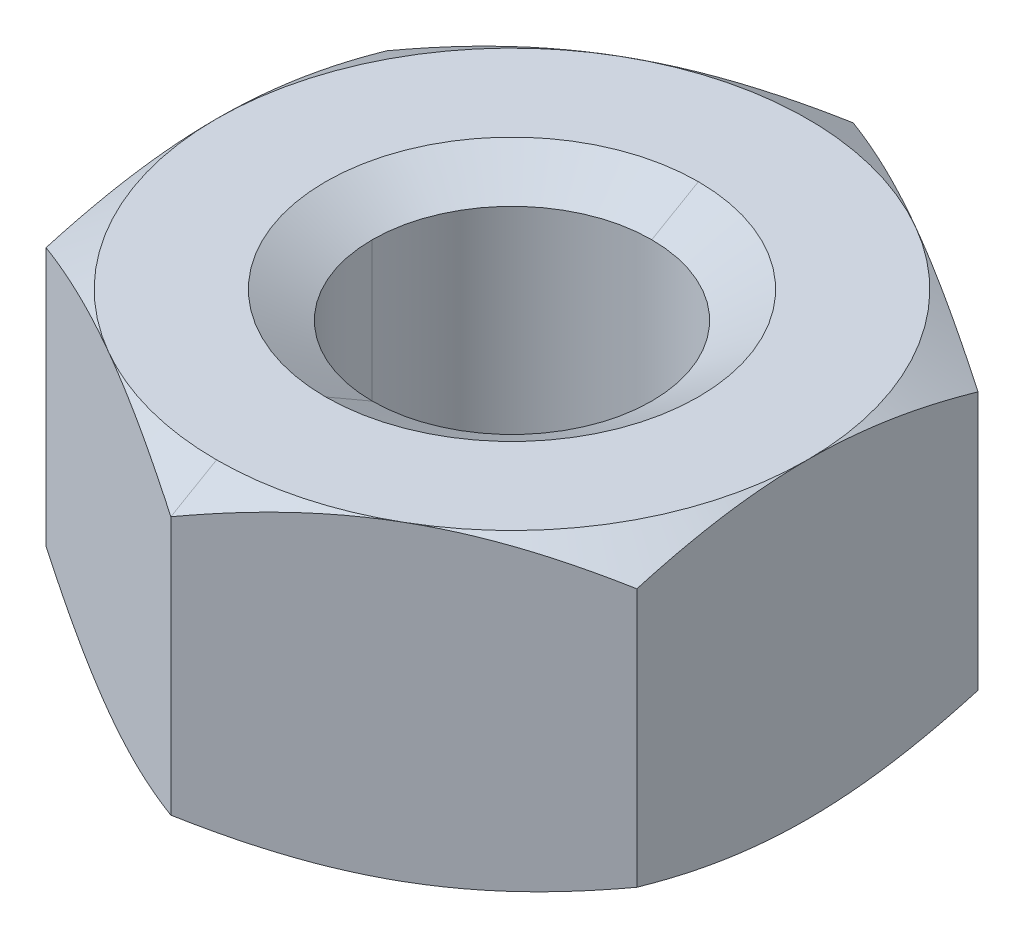
ISO-10303-21;
HEADER;
FILE_DESCRIPTION(('STEP AP214'),'2;1');
FILE_NAME('part.step','',(''),(''),'','','');
FILE_SCHEMA(('AUTOMOTIVE_DESIGN { 1 0 10303 214 1 1 1 1 }'));
ENDSEC;
DATA;
#1=APPLICATION_CONTEXT('core data for automotive mechanical design processes');
#2=APPLICATION_PROTOCOL_DEFINITION('international standard','automotive_design',2000,#1);
#3=PRODUCT_CONTEXT('',#1,'mechanical');
#4=PRODUCT('Part','Part','',(#3));
#5=PRODUCT_RELATED_PRODUCT_CATEGORY('part','',(#4));
#6=PRODUCT_DEFINITION_FORMATION('','',#4);
#7=PRODUCT_DEFINITION_CONTEXT('part definition',#1,'design');
#8=PRODUCT_DEFINITION('design','',#6,#7);
#9=PRODUCT_DEFINITION_SHAPE('','',#8);
#10=(LENGTH_UNIT() NAMED_UNIT(*) SI_UNIT(.MILLI.,.METRE.));
#11=(NAMED_UNIT(*) PLANE_ANGLE_UNIT() SI_UNIT($,.RADIAN.));
#12=(NAMED_UNIT(*) SI_UNIT($,.STERADIAN.) SOLID_ANGLE_UNIT());
#13=UNCERTAINTY_MEASURE_WITH_UNIT(LENGTH_MEASURE(1.E-05),#10,'distance_accuracy_value','');
#14=(GEOMETRIC_REPRESENTATION_CONTEXT(3) GLOBAL_UNCERTAINTY_ASSIGNED_CONTEXT((#13)) GLOBAL_UNIT_ASSIGNED_CONTEXT((#10,
#11,#12)) REPRESENTATION_CONTEXT('',''));
#15=CARTESIAN_POINT('',(0.,0.,0.));
#16=DIRECTION('',(0.,0.,1.));
#17=DIRECTION('',(1.,0.,0.));
#18=AXIS2_PLACEMENT_3D('',#15,#16,#17);
#19=CARTESIAN_POINT('',(86.966,103.008,0.));
#20=DIRECTION('',(0.,1.,0.));
#21=DIRECTION('',(0.,0.,1.));
#22=AXIS2_PLACEMENT_3D('',#19,#20,#21);
#23=CONICAL_SURFACE('',#22,5.9944,1.0471975511966);
#24=DIRECTION('',(0.,0.5,-0.86602540378444));
#25=VECTOR('',#24,1.);
#26=CARTESIAN_POINT('',(86.966,103.008,-5.9944));
#27=LINE('',#26,#25);
#28=CARTESIAN_POINT('',(86.966,102.141974596216,-4.49440000000007));
#29=VERTEX_POINT('',#28);
#30=CARTESIAN_POINT('',(86.966,103.008,-5.9944));
#31=VERTEX_POINT('',#30);
#32=EDGE_CURVE('E258',#29,#31,#27,.T.);
#33=ORIENTED_EDGE('',*,*,#32,.F.);
#34=CARTESIAN_POINT('',(86.966,102.141974596216,0.));
#35=DIRECTION('',(0.,1.,0.));
#36=DIRECTION('',(0.,0.,1.));
#37=AXIS2_PLACEMENT_3D('',#34,#35,#36);
#38=CIRCLE('',#37,4.49440000000007);
#39=CARTESIAN_POINT('',(91.4604,102.141974596216,0.));
#40=VERTEX_POINT('',#39);
#41=EDGE_CURVE('E11',#40,#29,#38,.T.);
#42=ORIENTED_EDGE('',*,*,#41,.F.);
#43=CARTESIAN_POINT('',(86.966,102.141974596216,0.));
#44=DIRECTION('',(0.,1.,0.));
#45=DIRECTION('',(0.,0.,1.));
#46=AXIS2_PLACEMENT_3D('',#43,#44,#45);
#47=CIRCLE('',#46,4.49440000000007);
#48=CARTESIAN_POINT('',(86.966,102.141974596216,4.49440000000007));
#49=VERTEX_POINT('',#48);
#50=EDGE_CURVE('E91',#49,#40,#47,.T.);
#51=ORIENTED_EDGE('',*,*,#50,.F.);
#52=DIRECTION('',(0.,0.5,0.86602540378444));
#53=VECTOR('',#52,1.);
#54=CARTESIAN_POINT('',(86.966,103.008,5.9944));
#55=LINE('',#54,#53);
#56=CARTESIAN_POINT('',(86.966,103.008,5.9944));
#57=VERTEX_POINT('',#56);
#58=EDGE_CURVE('E254',#49,#57,#55,.T.);
#59=ORIENTED_EDGE('',*,*,#58,.T.);
#60=CARTESIAN_POINT('',(86.966,103.008,0.));
#61=DIRECTION('',(0.,-1.,0.));
#62=DIRECTION('',(0.,0.,1.));
#63=AXIS2_PLACEMENT_3D('',#60,#61,#62);
#64=CIRCLE('',#63,5.9944);
#65=EDGE_CURVE('E51',#31,#57,#64,.T.);
#66=ORIENTED_EDGE('',*,*,#65,.F.);
#67=EDGE_LOOP('',(#33,#42,#51,#59,#66));
#68=FACE_BOUND('',#67,.T.);
#69=ADVANCED_FACE('F38',(#68),#23,.F.);
#70=CARTESIAN_POINT('',(86.966,93.0004,0.));
#71=DIRECTION('',(0.,1.,0.));
#72=DIRECTION('',(0.,0.,-1.));
#73=AXIS2_PLACEMENT_3D('',#70,#71,#72);
#74=CONICAL_SURFACE('',#73,9.4996,1.0471975511966);
#75=CARTESIAN_POINT('',(77.4664,93.8488700494729,5.48459661719378));
#76=CARTESIAN_POINT('',(78.7019089284808,93.4370337399786,6.19791802963837));
#77=CARTESIAN_POINT('',(79.8169469914146,93.2288766993012,6.84168555542987));
#78=CARTESIAN_POINT('',(81.0408316862839,93.0004,7.54829571346974));
#79=CARTESIAN_POINT('',(82.2162,93.0004,8.22689492579067));
#80=B_SPLINE_CURVE_WITH_KNOTS('',2,(#75,#76,#77,#78,#79),.UNSPECIFIED.,.F.,.F.,(3,2,3),(0.,0.5,
1.),.UNSPECIFIED.);
#81=CARTESIAN_POINT('',(77.4664,93.8488700494728,5.48459661719377));
#82=VERTEX_POINT('',#81);
#83=CARTESIAN_POINT('',(82.2162,93.0004,8.22689492579067));
#84=VERTEX_POINT('',#83);
#85=EDGE_CURVE('E443',#82,#84,#80,.T.);
#86=ORIENTED_EDGE('',*,*,#85,.F.);
#87=CARTESIAN_POINT('',(77.4664,93.0004,0.));
#88=CARTESIAN_POINT('',(77.4664,93.0004,1.36302312218737));
#89=CARTESIAN_POINT('',(77.4664,93.23105838735,2.78388561921775));
#90=CARTESIAN_POINT('',(77.4664,93.4389825683326,4.0647047317508));
#91=CARTESIAN_POINT('',(77.4664,93.8488700494729,5.48459661719377));
#92=B_SPLINE_CURVE_WITH_KNOTS('',2,(#87,#88,#89,#90,#91),.UNSPECIFIED.,.F.,.F.,(3,2,3),(0.,0.5,
1.),.UNSPECIFIED.);
#93=CARTESIAN_POINT('',(77.4664,93.0004,0.));
#94=VERTEX_POINT('',#93);
#95=EDGE_CURVE('E317',#94,#82,#92,.T.);
#96=ORIENTED_EDGE('',*,*,#95,.F.);
#97=CARTESIAN_POINT('',(86.966,93.0004,0.));
#98=DIRECTION('',(0.,-1.,0.));
#99=DIRECTION('',(0.,0.,1.));
#100=AXIS2_PLACEMENT_3D('',#97,#98,#99);
#101=CIRCLE('',#100,9.4996);
#102=EDGE_CURVE('E642',#84,#94,#101,.T.);
#103=ORIENTED_EDGE('',*,*,#102,.F.);
#104=EDGE_LOOP('',(#86,#96,#103));
#105=FACE_BOUND('',#104,.T.);
#106=ADVANCED_FACE('F325',(#105),#74,.T.);
#107=CARTESIAN_POINT('',(86.966,93.0004,0.));
#108=DIRECTION('',(0.,1.,0.));
#109=DIRECTION('',(0.,0.,-1.));
#110=AXIS2_PLACEMENT_3D('',#107,#108,#109);
#111=CONICAL_SURFACE('',#110,9.4996,1.0471975511966);
#112=CARTESIAN_POINT('',(82.2162,93.0004,-8.22689492579068));
#113=CARTESIAN_POINT('',(81.0398464616265,93.0004,-7.54772689374855));
#114=CARTESIAN_POINT('',(79.8139198548295,93.2294420372649,-6.83993783730757));
#115=CARTESIAN_POINT('',(78.700767190529,93.4374143192961,-6.19725884692456));
#116=CARTESIAN_POINT('',(77.4664,93.8488700494729,-5.48459661719378));
#117=B_SPLINE_CURVE_WITH_KNOTS('',2,(#112,#113,#114,#115,#116),.UNSPECIFIED.,.F.,.F.,(3,2,3),
(0.,0.5,1.),.UNSPECIFIED.);
#118=CARTESIAN_POINT('',(82.2162,93.0004,-8.22689492579067));
#119=VERTEX_POINT('',#118);
#120=CARTESIAN_POINT('',(77.4664,93.8488700494728,-5.48459661719378));
#121=VERTEX_POINT('',#120);
#122=EDGE_CURVE('E797',#119,#121,#117,.T.);
#123=ORIENTED_EDGE('',*,*,#122,.F.);
#124=CARTESIAN_POINT('',(86.966,93.0004,0.));
#125=DIRECTION('',(0.,1.,0.));
#126=DIRECTION('',(0.,0.,-1.));
#127=AXIS2_PLACEMENT_3D('',#124,#125,#126);
#128=CIRCLE('',#127,9.4996);
#129=EDGE_CURVE('E323',#119,#94,#128,.T.);
#130=ORIENTED_EDGE('',*,*,#129,.T.);
#131=CARTESIAN_POINT('',(77.4664,93.8488700494729,-5.48459661719377));
#132=CARTESIAN_POINT('',(77.4664,93.4359389183844,-4.05416121904976));
#133=CARTESIAN_POINT('',(77.4664,93.2277519686827,-2.76345251145925));
#134=CARTESIAN_POINT('',(77.4664,93.0004,-1.35392532405791));
#135=CARTESIAN_POINT('',(77.4664,93.0004,0.));
#136=B_SPLINE_CURVE_WITH_KNOTS('',2,(#131,#132,#133,#134,#135),.UNSPECIFIED.,.F.,.F.,(3,2,3),
(0.,0.5,1.),.UNSPECIFIED.);
#137=EDGE_CURVE('E806',#121,#94,#136,.T.);
#138=ORIENTED_EDGE('',*,*,#137,.F.);
#139=EDGE_LOOP('',(#123,#130,#138));
#140=FACE_BOUND('',#139,.T.);
#141=ADVANCED_FACE('F335',(#140),#111,.T.);
#142=CARTESIAN_POINT('',(86.966,93.0004,0.));
#143=DIRECTION('',(0.,1.,0.));
#144=DIRECTION('',(0.,0.,-1.));
#145=AXIS2_PLACEMENT_3D('',#142,#143,#144);
#146=CONICAL_SURFACE('',#145,9.4996,1.0471975511966);
#147=DIRECTION('',(0.,0.5,-0.86602540378444));
#148=VECTOR('',#147,1.);
#149=CARTESIAN_POINT('',(86.966,93.0004,-9.4996));
#150=LINE('',#149,#148);
#151=CARTESIAN_POINT('',(86.966,93.0004,-9.4996));
#152=VERTEX_POINT('',#151);
#153=CARTESIAN_POINT('',(86.966,93.8488700494728,-10.9691932343875));
#154=VERTEX_POINT('',#153);
#155=EDGE_CURVE('E509',#152,#154,#150,.T.);
#156=ORIENTED_EDGE('',*,*,#155,.F.);
#157=CARTESIAN_POINT('',(86.966,93.0004,0.));
#158=DIRECTION('',(0.,-1.,0.));
#159=DIRECTION('',(0.,0.,1.));
#160=AXIS2_PLACEMENT_3D('',#157,#158,#159);
#161=CIRCLE('',#160,9.4996);
#162=EDGE_CURVE('E627',#119,#152,#161,.T.);
#163=ORIENTED_EDGE('',*,*,#162,.F.);
#164=CARTESIAN_POINT('',(86.966,93.8488700494729,-10.9691932343876));
#165=CARTESIAN_POINT('',(85.7304910713691,93.4370337399286,-10.2558718218563));
#166=CARTESIAN_POINT('',(84.6154530085854,93.2288766993012,-9.61210429615148));
#167=CARTESIAN_POINT('',(83.3915683135868,93.0004,-8.90549413803694));
#168=CARTESIAN_POINT('',(82.2162,93.0004,-8.22689492579068));
#169=B_SPLINE_CURVE_WITH_KNOTS('',2,(#164,#165,#166,#167,#168),.UNSPECIFIED.,.F.,.F.,(3,2,3),
(0.,0.5,1.),.UNSPECIFIED.);
#170=EDGE_CURVE('E238',#154,#119,#169,.T.);
#171=ORIENTED_EDGE('',*,*,#170,.F.);
#172=EDGE_LOOP('',(#156,#163,#171));
#173=FACE_BOUND('',#172,.T.);
#174=ADVANCED_FACE('F607',(#173),#146,.T.);
#175=CARTESIAN_POINT('',(86.966,93.0004,0.));
#176=DIRECTION('',(0.,1.,0.));
#177=DIRECTION('',(0.,0.,-1.));
#178=AXIS2_PLACEMENT_3D('',#175,#176,#177);
#179=CONICAL_SURFACE('',#178,9.4996,1.0471975511966);
#180=CARTESIAN_POINT('',(96.4656,93.0004,0.));
#181=CARTESIAN_POINT('',(96.4656,93.0004,-1.35341300572912));
#182=CARTESIAN_POINT('',(96.4656,93.2277519686823,-2.76345251145672));
#183=CARTESIAN_POINT('',(96.4656,93.4357675717653,-4.05356765694959));
#184=CARTESIAN_POINT('',(96.4656,93.8488700494729,-5.48459661719377));
#185=B_SPLINE_CURVE_WITH_KNOTS('',2,(#180,#181,#182,#183,#184),.UNSPECIFIED.,.F.,.F.,(3,2,3),
(0.,0.5,1.),.UNSPECIFIED.);
#186=CARTESIAN_POINT('',(96.4656,93.0004,0.));
#187=VERTEX_POINT('',#186);
#188=CARTESIAN_POINT('',(96.4656,93.8488700494728,-5.48459661719377));
#189=VERTEX_POINT('',#188);
#190=EDGE_CURVE('E533',#187,#189,#185,.T.);
#191=ORIENTED_EDGE('',*,*,#190,.F.);
#192=CARTESIAN_POINT('',(86.966,93.0004,0.));
#193=DIRECTION('',(0.,-1.,0.));
#194=DIRECTION('',(0.,0.,1.));
#195=AXIS2_PLACEMENT_3D('',#192,#193,#194);
#196=CIRCLE('',#195,9.4996);
#197=CARTESIAN_POINT('',(91.7158,93.0004,-8.22689492579067));
#198=VERTEX_POINT('',#197);
#199=EDGE_CURVE('E619',#198,#187,#196,.T.);
#200=ORIENTED_EDGE('',*,*,#199,.F.);
#201=CARTESIAN_POINT('',(96.4656,93.8488700494729,-5.48459661719377));
#202=CARTESIAN_POINT('',(95.2300910714615,93.4370337399594,-6.19791802967168));
#203=CARTESIAN_POINT('',(94.1150530085854,93.2288766993012,-6.84168555542985));
#204=CARTESIAN_POINT('',(92.8911683136669,93.0004,-7.54829571349814));
#205=CARTESIAN_POINT('',(91.7158,93.0004,-8.22689492579063));
#206=B_SPLINE_CURVE_WITH_KNOTS('',2,(#201,#202,#203,#204,#205),.UNSPECIFIED.,.F.,.F.,(3,2,3),
(0.,0.5,1.),.UNSPECIFIED.);
#207=EDGE_CURVE('E591',#189,#198,#206,.T.);
#208=ORIENTED_EDGE('',*,*,#207,.F.);
#209=EDGE_LOOP('',(#191,#200,#208));
#210=FACE_BOUND('',#209,.T.);
#211=ADVANCED_FACE('F598',(#210),#179,.T.);
#212=CARTESIAN_POINT('',(86.966,93.0004,0.));
#213=DIRECTION('',(0.,1.,0.));
#214=DIRECTION('',(0.,0.,-1.));
#215=AXIS2_PLACEMENT_3D('',#212,#213,#214);
#216=CONICAL_SURFACE('',#215,9.4996,1.0471975511966);
#217=CARTESIAN_POINT('',(96.4656,93.8488700494729,5.48459661719377));
#218=CARTESIAN_POINT('',(96.4656,93.439151381845,4.06528951891212));
#219=CARTESIAN_POINT('',(96.4656,93.2310583873496,2.78388561921574));
#220=CARTESIAN_POINT('',(96.4656,93.0004,1.3635275828278));
#221=CARTESIAN_POINT('',(96.4656,93.0004,0.));
#222=B_SPLINE_CURVE_WITH_KNOTS('',2,(#217,#218,#219,#220,#221),.UNSPECIFIED.,.F.,.F.,(3,2,3),
(0.,0.5,1.),.UNSPECIFIED.);
#223=CARTESIAN_POINT('',(96.4656,93.8488700494728,5.48459661719377));
#224=VERTEX_POINT('',#223);
#225=EDGE_CURVE('E522',#224,#187,#222,.T.);
#226=ORIENTED_EDGE('',*,*,#225,.F.);
#227=CARTESIAN_POINT('',(91.7158,93.0004,8.22689492579063));
#228=CARTESIAN_POINT('',(92.8921535385219,93.0004,7.54772689366284));
#229=CARTESIAN_POINT('',(94.1180801451706,93.2294420372649,6.83993783730752));
#230=CARTESIAN_POINT('',(95.2312328096419,93.4374143193532,6.19725884682586));
#231=CARTESIAN_POINT('',(96.4656,93.8488700494729,5.48459661719377));
#232=B_SPLINE_CURVE_WITH_KNOTS('',2,(#227,#228,#229,#230,#231),.UNSPECIFIED.,.F.,.F.,(3,2,3),
(0.,0.5,1.),.UNSPECIFIED.);
#233=CARTESIAN_POINT('',(91.7158,93.0004,8.22689492579067));
#234=VERTEX_POINT('',#233);
#235=EDGE_CURVE('E472',#234,#224,#232,.T.);
#236=ORIENTED_EDGE('',*,*,#235,.F.);
#237=CARTESIAN_POINT('',(86.966,93.0004,0.));
#238=DIRECTION('',(0.,-1.,0.));
#239=DIRECTION('',(0.,0.,1.));
#240=AXIS2_PLACEMENT_3D('',#237,#238,#239);
#241=CIRCLE('',#240,9.4996);
#242=EDGE_CURVE('E437',#187,#234,#241,.T.);
#243=ORIENTED_EDGE('',*,*,#242,.F.);
#244=EDGE_LOOP('',(#226,#236,#243));
#245=FACE_BOUND('',#244,.T.);
#246=ADVANCED_FACE('F289',(#245),#216,.T.);
#247=CARTESIAN_POINT('',(86.966,93.0004,0.));
#248=DIRECTION('',(0.,1.,0.));
#249=DIRECTION('',(0.,0.,-1.));
#250=AXIS2_PLACEMENT_3D('',#247,#248,#249);
#251=CONICAL_SURFACE('',#250,9.4996,1.0471975511966);
#252=CARTESIAN_POINT('',(86.966,93.8488700494729,10.9691932343875));
#253=CARTESIAN_POINT('',(88.2015089285018,93.4370337399717,10.2558718219309));
#254=CARTESIAN_POINT('',(89.3165469914146,93.2288766993012,9.61210429615145));
#255=CARTESIAN_POINT('',(90.5404316863015,93.0004,8.90549413810141));
#256=CARTESIAN_POINT('',(91.7158,93.0004,8.22689492579063));
#257=B_SPLINE_CURVE_WITH_KNOTS('',2,(#252,#253,#254,#255,#256),.UNSPECIFIED.,.F.,.F.,(3,2,3),
(0.,0.5,1.),.UNSPECIFIED.);
#258=CARTESIAN_POINT('',(86.966,93.8488700494728,10.9691932343875));
#259=VERTEX_POINT('',#258);
#260=EDGE_CURVE('E404',#259,#234,#257,.T.);
#261=ORIENTED_EDGE('',*,*,#260,.F.);
#262=CARTESIAN_POINT('',(82.2162,93.0004,8.22689492579067));
#263=CARTESIAN_POINT('',(83.3925535383645,93.0004,8.90606295782758));
#264=CARTESIAN_POINT('',(84.6184801451706,93.2294420372649,9.61385201427381));
#265=CARTESIAN_POINT('',(85.7316328094596,93.4374143192924,10.2565310046502));
#266=CARTESIAN_POINT('',(86.966,93.8488700494729,10.9691932343875));
#267=B_SPLINE_CURVE_WITH_KNOTS('',2,(#262,#263,#264,#265,#266),.UNSPECIFIED.,.F.,.F.,(3,2,3),
(0.,0.5,1.),.UNSPECIFIED.);
#268=EDGE_CURVE('E452',#84,#259,#267,.T.);
#269=ORIENTED_EDGE('',*,*,#268,.F.);
#270=CARTESIAN_POINT('',(86.966,93.0004,0.));
#271=DIRECTION('',(0.,-1.,0.));
#272=DIRECTION('',(0.,0.,1.));
#273=AXIS2_PLACEMENT_3D('',#270,#271,#272);
#274=CIRCLE('',#273,9.4996);
#275=EDGE_CURVE('E228',#234,#84,#274,.T.);
#276=ORIENTED_EDGE('',*,*,#275,.F.);
#277=EDGE_LOOP('',(#261,#269,#276));
#278=FACE_BOUND('',#277,.T.);
#279=ADVANCED_FACE('F411',(#278),#251,.T.);
#280=CARTESIAN_POINT('',(86.966,103.008,0.));
#281=DIRECTION('',(0.,-1.,0.));
#282=DIRECTION('',(0.,0.,1.));
#283=AXIS2_PLACEMENT_3D('',#280,#281,#282);
#284=CONICAL_SURFACE('',#283,9.4996,1.0471975511966);
#285=CARTESIAN_POINT('',(82.2162,103.008,-8.22689492579067));
#286=CARTESIAN_POINT('',(83.3925535379302,103.008,-8.90606295757681));
#287=CARTESIAN_POINT('',(84.6184801451706,102.778957962735,-9.61385201427379));
#288=CARTESIAN_POINT('',(85.7316328089558,102.570985680876,-10.2565310043593));
#289=CARTESIAN_POINT('',(86.966,102.159529950527,-10.9691932343875));
#290=B_SPLINE_CURVE_WITH_KNOTS('',2,(#285,#286,#287,#288,#289),.UNSPECIFIED.,.F.,.F.,(3,2,3),
(0.,0.5,1.),.UNSPECIFIED.);
#291=CARTESIAN_POINT('',(82.2162,103.008,-8.22689492579067));
#292=VERTEX_POINT('',#291);
#293=CARTESIAN_POINT('',(86.966,102.159529950527,-10.9691932343875));
#294=VERTEX_POINT('',#293);
#295=EDGE_CURVE('E718',#292,#294,#290,.T.);
#296=ORIENTED_EDGE('',*,*,#295,.F.);
#297=CARTESIAN_POINT('',(86.966,103.008,0.));
#298=DIRECTION('',(0.,-1.,0.));
#299=DIRECTION('',(0.,0.,1.));
#300=AXIS2_PLACEMENT_3D('',#297,#298,#299);
#301=CIRCLE('',#300,9.4996);
#302=CARTESIAN_POINT('',(91.7158,103.008,-8.22689492579065));
#303=VERTEX_POINT('',#302);
#304=EDGE_CURVE('E695',#292,#303,#301,.T.);
#305=ORIENTED_EDGE('',*,*,#304,.T.);
#306=CARTESIAN_POINT('',(86.966,102.159529950527,-10.9691932343875));
#307=CARTESIAN_POINT('',(88.2015089283859,102.57136625999,-10.2558718219978));
#308=CARTESIAN_POINT('',(89.3165469914146,102.779523300699,-9.61210429615146));
#309=CARTESIAN_POINT('',(90.5404316862011,103.008,-8.90549413815939));
#310=CARTESIAN_POINT('',(91.7158,103.008,-8.22689492579064));
#311=B_SPLINE_CURVE_WITH_KNOTS('',2,(#306,#307,#308,#309,#310),.UNSPECIFIED.,.F.,.F.,(3,2,3),
(0.,0.5,1.),.UNSPECIFIED.);
#312=EDGE_CURVE('E706',#294,#303,#311,.T.);
#313=ORIENTED_EDGE('',*,*,#312,.F.);
#314=EDGE_LOOP('',(#296,#305,#313));
#315=FACE_BOUND('',#314,.T.);
#316=ADVANCED_FACE('F419',(#315),#284,.T.);
#317=CARTESIAN_POINT('',(86.966,103.008,0.));
#318=DIRECTION('',(0.,-1.,0.));
#319=DIRECTION('',(0.,0.,1.));
#320=AXIS2_PLACEMENT_3D('',#317,#318,#319);
#321=CONICAL_SURFACE('',#320,9.4996,1.0471975511966);
#322=CARTESIAN_POINT('',(91.7158,103.008,-8.22689492579064));
#323=CARTESIAN_POINT('',(92.8921535381863,103.008,-7.54772689385664));
#324=CARTESIAN_POINT('',(94.1180801451706,102.778957962735,-6.83993783730752));
#325=CARTESIAN_POINT('',(95.2312328092525,102.570985680777,-6.19725884705067));
#326=CARTESIAN_POINT('',(96.4656,102.159529950527,-5.48459661719378));
#327=B_SPLINE_CURVE_WITH_KNOTS('',2,(#322,#323,#324,#325,#326),.UNSPECIFIED.,.F.,.F.,(3,2,3),
(0.,0.5,1.),.UNSPECIFIED.);
#328=CARTESIAN_POINT('',(96.4656,102.159529950527,-5.48459661719377));
#329=VERTEX_POINT('',#328);
#330=EDGE_CURVE('E553',#303,#329,#327,.T.);
#331=ORIENTED_EDGE('',*,*,#330,.F.);
#332=CARTESIAN_POINT('',(86.966,103.008,0.));
#333=DIRECTION('',(0.,-1.,0.));
#334=DIRECTION('',(0.,0.,1.));
#335=AXIS2_PLACEMENT_3D('',#332,#333,#334);
#336=CIRCLE('',#335,9.4996);
#337=CARTESIAN_POINT('',(96.4656,103.008,0.));
#338=VERTEX_POINT('',#337);
#339=EDGE_CURVE('E703',#303,#338,#336,.T.);
#340=ORIENTED_EDGE('',*,*,#339,.T.);
#341=CARTESIAN_POINT('',(96.4656,102.159529950527,-5.48459661719377));
#342=CARTESIAN_POINT('',(96.4656,102.572461081576,-4.0541612191853));
#343=CARTESIAN_POINT('',(96.4656,102.780648031318,-2.76345251145672));
#344=CARTESIAN_POINT('',(96.4656,103.008,-1.35392532417536));
#345=CARTESIAN_POINT('',(96.4656,103.008,0.));
#346=B_SPLINE_CURVE_WITH_KNOTS('',2,(#341,#342,#343,#344,#345),.UNSPECIFIED.,.F.,.F.,(3,2,3),
(0.,0.5,1.),.UNSPECIFIED.);
#347=EDGE_CURVE('E1237',#329,#338,#346,.T.);
#348=ORIENTED_EDGE('',*,*,#347,.F.);
#349=EDGE_LOOP('',(#331,#340,#348));
#350=FACE_BOUND('',#349,.T.);
#351=ADVANCED_FACE('F680',(#350),#321,.T.);
#352=CARTESIAN_POINT('',(86.966,103.008,0.));
#353=DIRECTION('',(0.,-1.,0.));
#354=DIRECTION('',(0.,0.,1.));
#355=AXIS2_PLACEMENT_3D('',#352,#353,#354);
#356=CONICAL_SURFACE('',#355,9.4996,1.0471975511966);
#357=CARTESIAN_POINT('',(96.4656,103.008,0.));
#358=CARTESIAN_POINT('',(96.4656,103.008,1.36302312200608));
#359=CARTESIAN_POINT('',(96.4656,102.77734161265,2.78388561921576));
#360=CARTESIAN_POINT('',(96.4656,102.569417431728,4.06470473154006));
#361=CARTESIAN_POINT('',(96.4656,102.159529950527,5.48459661719377));
#362=B_SPLINE_CURVE_WITH_KNOTS('',2,(#357,#358,#359,#360,#361),.UNSPECIFIED.,.F.,.F.,(3,2,3),
(0.,0.5,1.),.UNSPECIFIED.);
#363=CARTESIAN_POINT('',(96.4656,102.159529950527,5.48459661719377));
#364=VERTEX_POINT('',#363);
#365=EDGE_CURVE('E526',#338,#364,#362,.T.);
#366=ORIENTED_EDGE('',*,*,#365,.F.);
#367=CARTESIAN_POINT('',(86.966,103.008,0.));
#368=DIRECTION('',(0.,-1.,0.));
#369=DIRECTION('',(0.,0.,1.));
#370=AXIS2_PLACEMENT_3D('',#367,#368,#369);
#371=CIRCLE('',#370,9.4996);
#372=CARTESIAN_POINT('',(91.7158,103.008,8.22689492579064));
#373=VERTEX_POINT('',#372);
#374=EDGE_CURVE('E227',#338,#373,#371,.T.);
#375=ORIENTED_EDGE('',*,*,#374,.T.);
#376=CARTESIAN_POINT('',(96.4656,102.159529950527,5.48459661719377));
#377=CARTESIAN_POINT('',(95.230091071617,102.571366259989,6.19791802958189));
#378=CARTESIAN_POINT('',(94.1150530085854,102.779523300699,6.84168555542983));
#379=CARTESIAN_POINT('',(92.8911683138015,103.008,7.54829571342039));
#380=CARTESIAN_POINT('',(91.7158,103.008,8.22689492579064));
#381=B_SPLINE_CURVE_WITH_KNOTS('',2,(#376,#377,#378,#379,#380),.UNSPECIFIED.,.F.,.F.,(3,2,3),
(0.,0.5,1.),.UNSPECIFIED.);
#382=EDGE_CURVE('E357',#364,#373,#381,.T.);
#383=ORIENTED_EDGE('',*,*,#382,.F.);
#384=EDGE_LOOP('',(#366,#375,#383));
#385=FACE_BOUND('',#384,.T.);
#386=ADVANCED_FACE('F374',(#385),#356,.T.);
#387=CARTESIAN_POINT('',(86.966,103.008,0.));
#388=DIRECTION('',(0.,-1.,0.));
#389=DIRECTION('',(0.,0.,1.));
#390=AXIS2_PLACEMENT_3D('',#387,#388,#389);
#391=CONICAL_SURFACE('',#390,9.4996,1.0471975511966);
#392=DIRECTION('',(0.,-0.5,0.86602540378444));
#393=VECTOR('',#392,1.);
#394=CARTESIAN_POINT('',(86.966,103.008,9.4996));
#395=LINE('',#394,#393);
#396=CARTESIAN_POINT('',(86.966,103.008,9.4996));
#397=VERTEX_POINT('',#396);
#398=CARTESIAN_POINT('',(86.966,102.159529950527,10.9691932343875));
#399=VERTEX_POINT('',#398);
#400=EDGE_CURVE('E480',#397,#399,#395,.T.);
#401=ORIENTED_EDGE('',*,*,#400,.F.);
#402=CARTESIAN_POINT('',(86.966,103.008,0.));
#403=DIRECTION('',(0.,-1.,0.));
#404=DIRECTION('',(0.,0.,1.));
#405=AXIS2_PLACEMENT_3D('',#402,#403,#404);
#406=CIRCLE('',#405,9.4996);
#407=CARTESIAN_POINT('',(82.2162,103.008,8.22689492579067));
#408=VERTEX_POINT('',#407);
#409=EDGE_CURVE('E264',#397,#408,#406,.T.);
#410=ORIENTED_EDGE('',*,*,#409,.T.);
#411=CARTESIAN_POINT('',(86.966,102.159529950527,10.9691932343875));
#412=CARTESIAN_POINT('',(85.7304910715937,102.571366259996,10.255871821986));
#413=CARTESIAN_POINT('',(84.6154530085854,102.779523300699,9.61210429615147));
#414=CARTESIAN_POINT('',(83.391568313781,103.008,8.90549413814905));
#415=CARTESIAN_POINT('',(82.2162,103.008,8.22689492579067));
#416=B_SPLINE_CURVE_WITH_KNOTS('',2,(#411,#412,#413,#414,#415),.UNSPECIFIED.,.F.,.F.,(3,2,3),
(0.,0.5,1.),.UNSPECIFIED.);
#417=EDGE_CURVE('E464',#399,#408,#416,.T.);
#418=ORIENTED_EDGE('',*,*,#417,.F.);
#419=EDGE_LOOP('',(#401,#410,#418));
#420=FACE_BOUND('',#419,.T.);
#421=ADVANCED_FACE('F775',(#420),#391,.T.);
#422=CARTESIAN_POINT('',(86.966,103.008,0.));
#423=DIRECTION('',(0.,-1.,0.));
#424=DIRECTION('',(0.,0.,1.));
#425=AXIS2_PLACEMENT_3D('',#422,#423,#424);
#426=CONICAL_SURFACE('',#425,9.4996,1.0471975511966);
#427=CARTESIAN_POINT('',(82.2162,103.008,8.22689492579067));
#428=CARTESIAN_POINT('',(81.0398464618099,103.008,7.54772689385446));
#429=CARTESIAN_POINT('',(79.8139198548294,102.778957962735,6.83993783730753));
#430=CARTESIAN_POINT('',(78.7007671907429,102.570985680775,6.19725884704801));
#431=CARTESIAN_POINT('',(77.4664,102.159529950527,5.48459661719378));
#432=B_SPLINE_CURVE_WITH_KNOTS('',2,(#427,#428,#429,#430,#431),.UNSPECIFIED.,.F.,.F.,(3,2,3),
(0.,0.5,1.),.UNSPECIFIED.);
#433=CARTESIAN_POINT('',(77.4664,102.159529950527,5.48459661719377));
#434=VERTEX_POINT('',#433);
#435=EDGE_CURVE('E815',#408,#434,#432,.T.);
#436=ORIENTED_EDGE('',*,*,#435,.F.);
#437=CARTESIAN_POINT('',(86.966,103.008,0.));
#438=DIRECTION('',(0.,-1.,0.));
#439=DIRECTION('',(0.,0.,1.));
#440=AXIS2_PLACEMENT_3D('',#437,#438,#439);
#441=CIRCLE('',#440,9.4996);
#442=CARTESIAN_POINT('',(77.4664,103.008,0.));
#443=VERTEX_POINT('',#442);
#444=EDGE_CURVE('E65',#408,#443,#441,.T.);
#445=ORIENTED_EDGE('',*,*,#444,.T.);
#446=CARTESIAN_POINT('',(77.4664,102.159529950527,5.48459661719377));
#447=CARTESIAN_POINT('',(77.4664,102.569248618079,4.06528951917682));
#448=CARTESIAN_POINT('',(77.4664,102.77734161265,2.78388561921775));
#449=CARTESIAN_POINT('',(77.4664,103.008,1.36352758305683));
#450=CARTESIAN_POINT('',(77.4664,103.008,0.));
#451=B_SPLINE_CURVE_WITH_KNOTS('',2,(#446,#447,#448,#449,#450),.UNSPECIFIED.,.F.,.F.,(3,2,3),
(0.,0.5,1.),.UNSPECIFIED.);
#452=EDGE_CURVE('E799',#434,#443,#451,.T.);
#453=ORIENTED_EDGE('',*,*,#452,.F.);
#454=EDGE_LOOP('',(#436,#445,#453));
#455=FACE_BOUND('',#454,.T.);
#456=ADVANCED_FACE('F737',(#455),#426,.T.);
#457=CARTESIAN_POINT('',(86.966,103.008,0.));
#458=DIRECTION('',(0.,-1.,0.));
#459=DIRECTION('',(0.,0.,1.));
#460=AXIS2_PLACEMENT_3D('',#457,#458,#459);
#461=CONICAL_SURFACE('',#460,9.4996,1.0471975511966);
#462=CARTESIAN_POINT('',(77.4664,102.159529950527,-5.48459661719378));
#463=CARTESIAN_POINT('',(78.7019089284062,102.571366259996,-6.1979180295953));
#464=CARTESIAN_POINT('',(79.8169469914146,102.779523300699,-6.84168555542986));
#465=CARTESIAN_POINT('',(81.0408316862191,103.008,-7.54829571343228));
#466=CARTESIAN_POINT('',(82.2162,103.008,-8.22689492579067));
#467=B_SPLINE_CURVE_WITH_KNOTS('',2,(#462,#463,#464,#465,#466),.UNSPECIFIED.,.F.,.F.,(3,2,3),
(0.,0.5,1.),.UNSPECIFIED.);
#468=CARTESIAN_POINT('',(77.4664,102.159529950527,-5.48459661719378));
#469=VERTEX_POINT('',#468);
#470=EDGE_CURVE('E725',#469,#292,#467,.T.);
#471=ORIENTED_EDGE('',*,*,#470,.F.);
#472=CARTESIAN_POINT('',(77.4664,103.008,0.));
#473=CARTESIAN_POINT('',(77.4664,103.008,-1.35341300515855));
#474=CARTESIAN_POINT('',(77.4664,102.780648031317,-2.76345251145925));
#475=CARTESIAN_POINT('',(77.4664,102.572632428426,-4.05356765628856));
#476=CARTESIAN_POINT('',(77.4664,102.159529950527,-5.48459661719377));
#477=B_SPLINE_CURVE_WITH_KNOTS('',2,(#472,#473,#474,#475,#476),.UNSPECIFIED.,.F.,.F.,(3,2,3),
(0.,0.5,1.),.UNSPECIFIED.);
#478=EDGE_CURVE('E175',#443,#469,#477,.T.);
#479=ORIENTED_EDGE('',*,*,#478,.F.);
#480=CARTESIAN_POINT('',(86.966,103.008,0.));
#481=DIRECTION('',(0.,-1.,0.));
#482=DIRECTION('',(0.,0.,1.));
#483=AXIS2_PLACEMENT_3D('',#480,#481,#482);
#484=CIRCLE('',#483,9.4996);
#485=EDGE_CURVE('E186',#443,#292,#484,.T.);
#486=ORIENTED_EDGE('',*,*,#485,.T.);
#487=EDGE_LOOP('',(#471,#479,#486));
#488=FACE_BOUND('',#487,.T.);
#489=ADVANCED_FACE('F767',(#488),#461,.T.);
#490=CARTESIAN_POINT('',(86.966,103.008,0.));
#491=DIRECTION('',(0.,-1.,0.));
#492=DIRECTION('',(-1.,0.,0.));
#493=AXIS2_PLACEMENT_3D('',#490,#491,#492);
#494=CYLINDRICAL_SURFACE('',#493,4.49440000000006);
#495=DIRECTION('',(0.,-1.,0.));
#496=VECTOR('',#495,1.);
#497=CARTESIAN_POINT('',(91.4604,103.008,0.));
#498=LINE('',#497,#496);
#499=CARTESIAN_POINT('',(91.4604,93.0004,0.));
#500=VERTEX_POINT('',#499);
#501=EDGE_CURVE('E241',#40,#500,#498,.T.);
#502=ORIENTED_EDGE('',*,*,#501,.F.);
#503=ORIENTED_EDGE('',*,*,#41,.T.);
#504=CARTESIAN_POINT('',(86.966,102.141974596216,0.));
#505=DIRECTION('',(0.,1.,0.));
#506=DIRECTION('',(0.,0.,1.));
#507=AXIS2_PLACEMENT_3D('',#504,#505,#506);
#508=CIRCLE('',#507,4.49440000000007);
#509=CARTESIAN_POINT('',(82.4716,102.141974596216,0.));
#510=VERTEX_POINT('',#509);
#511=EDGE_CURVE('E234',#29,#510,#508,.T.);
#512=ORIENTED_EDGE('',*,*,#511,.T.);
#513=DIRECTION('',(0.,-1.,0.));
#514=VECTOR('',#513,1.);
#515=CARTESIAN_POINT('',(82.4716,103.008,0.));
#516=LINE('',#515,#514);
#517=CARTESIAN_POINT('',(82.4716,93.0004,0.));
#518=VERTEX_POINT('',#517);
#519=EDGE_CURVE('E232',#510,#518,#516,.T.);
#520=ORIENTED_EDGE('',*,*,#519,.T.);
#521=CARTESIAN_POINT('',(86.966,93.0004,0.));
#522=DIRECTION('',(0.,-1.,0.));
#523=DIRECTION('',(1.,0.,0.));
#524=AXIS2_PLACEMENT_3D('',#521,#522,#523);
#525=CIRCLE('',#524,4.49440000000006);
#526=EDGE_CURVE('E216',#518,#500,#525,.T.);
#527=ORIENTED_EDGE('',*,*,#526,.T.);
#528=EDGE_LOOP('',(#502,#503,#512,#520,#527));
#529=FACE_BOUND('',#528,.T.);
#530=ADVANCED_FACE('F40',(#529),#494,.F.);
#531=CARTESIAN_POINT('',(0.,103.008,0.));
#532=DIRECTION('',(0.,1.,0.));
#533=DIRECTION('',(1.,0.,0.));
#534=AXIS2_PLACEMENT_3D('',#531,#532,#533);
#535=PLANE('',#534);
#536=CARTESIAN_POINT('',(86.966,103.008,0.));
#537=DIRECTION('',(0.,-1.,0.));
#538=DIRECTION('',(0.,0.,1.));
#539=AXIS2_PLACEMENT_3D('',#536,#537,#538);
#540=CIRCLE('',#539,5.9944);
#541=EDGE_CURVE('E252',#57,#31,#540,.T.);
#542=ORIENTED_EDGE('',*,*,#541,.T.);
#543=ORIENTED_EDGE('',*,*,#65,.T.);
#544=EDGE_LOOP('',(#542,#543));
#545=FACE_BOUND('',#544,.T.);
#546=CARTESIAN_POINT('',(86.966,103.008,0.));
#547=DIRECTION('',(0.,-1.,0.));
#548=DIRECTION('',(0.,0.,1.));
#549=AXIS2_PLACEMENT_3D('',#546,#547,#548);
#550=CIRCLE('',#549,9.4996);
#551=EDGE_CURVE('E484',#373,#397,#550,.T.);
#552=ORIENTED_EDGE('',*,*,#551,.F.);
#553=ORIENTED_EDGE('',*,*,#374,.F.);
#554=ORIENTED_EDGE('',*,*,#339,.F.);
#555=ORIENTED_EDGE('',*,*,#304,.F.);
#556=ORIENTED_EDGE('',*,*,#485,.F.);
#557=ORIENTED_EDGE('',*,*,#444,.F.);
#558=ORIENTED_EDGE('',*,*,#409,.F.);
#559=EDGE_LOOP('',(#552,#553,#554,#555,#556,#557,#558));
#560=FACE_BOUND('',#559,.T.);
#561=ADVANCED_FACE('F677',(#545,#560),#535,.T.);
#562=CARTESIAN_POINT('',(0.,93.0004,0.));
#563=DIRECTION('',(0.,1.,0.));
#564=DIRECTION('',(1.,0.,0.));
#565=AXIS2_PLACEMENT_3D('',#562,#563,#564);
#566=PLANE('',#565);
#567=ORIENTED_EDGE('',*,*,#526,.F.);
#568=CARTESIAN_POINT('',(86.966,93.0004,0.));
#569=DIRECTION('',(0.,-1.,0.));
#570=DIRECTION('',(1.,0.,0.));
#571=AXIS2_PLACEMENT_3D('',#568,#569,#570);
#572=CIRCLE('',#571,4.49440000000006);
#573=EDGE_CURVE('E224',#500,#518,#572,.T.);
#574=ORIENTED_EDGE('',*,*,#573,.F.);
#575=EDGE_LOOP('',(#567,#574));
#576=FACE_BOUND('',#575,.T.);
#577=ORIENTED_EDGE('',*,*,#102,.T.);
#578=ORIENTED_EDGE('',*,*,#129,.F.);
#579=ORIENTED_EDGE('',*,*,#162,.T.);
#580=CARTESIAN_POINT('',(86.966,93.0004,0.));
#581=DIRECTION('',(0.,-1.,0.));
#582=DIRECTION('',(0.,0.,1.));
#583=AXIS2_PLACEMENT_3D('',#580,#581,#582);
#584=CIRCLE('',#583,9.4996);
#585=EDGE_CURVE('E596',#152,#198,#584,.T.);
#586=ORIENTED_EDGE('',*,*,#585,.T.);
#587=ORIENTED_EDGE('',*,*,#199,.T.);
#588=ORIENTED_EDGE('',*,*,#242,.T.);
#589=ORIENTED_EDGE('',*,*,#275,.T.);
#590=EDGE_LOOP('',(#577,#578,#579,#586,#587,#588,#589));
#591=FACE_BOUND('',#590,.T.);
#592=ADVANCED_FACE('F221',(#576,#591),#566,.F.);
#593=CARTESIAN_POINT('',(77.4664,103.008,5.48459661719377));
#594=DIRECTION('',(1.,0.,0.));
#595=DIRECTION('',(0.,-1.,0.));
#596=AXIS2_PLACEMENT_3D('',#593,#594,#595);
#597=PLANE('',#596);
#598=ORIENTED_EDGE('',*,*,#137,.T.);
#599=ORIENTED_EDGE('',*,*,#95,.T.);
#600=DIRECTION('',(0.,-1.,0.));
#601=VECTOR('',#600,1.);
#602=CARTESIAN_POINT('',(77.4664,103.008,5.48459661719377));
#603=LINE('',#602,#601);
#604=EDGE_CURVE('E457',#434,#82,#603,.T.);
#605=ORIENTED_EDGE('',*,*,#604,.F.);
#606=ORIENTED_EDGE('',*,*,#452,.T.);
#607=ORIENTED_EDGE('',*,*,#478,.T.);
#608=DIRECTION('',(0.,-1.,0.));
#609=VECTOR('',#608,1.);
#610=CARTESIAN_POINT('',(77.4664,103.008,-5.48459661719378));
#611=LINE('',#610,#609);
#612=EDGE_CURVE('E794',#469,#121,#611,.T.);
#613=ORIENTED_EDGE('',*,*,#612,.T.);
#614=EDGE_LOOP('',(#598,#599,#605,#606,#607,#613));
#615=FACE_BOUND('',#614,.T.);
#616=ADVANCED_FACE('F275',(#615),#597,.F.);
#617=CARTESIAN_POINT('',(86.966,103.008,10.9691932343875));
#618=DIRECTION('',(0.5,0.,-0.866025403784439));
#619=DIRECTION('',(0.,-1.,0.));
#620=AXIS2_PLACEMENT_3D('',#617,#618,#619);
#621=PLANE('',#620);
#622=ORIENTED_EDGE('',*,*,#85,.T.);
#623=ORIENTED_EDGE('',*,*,#268,.T.);
#624=DIRECTION('',(0.,-1.,0.));
#625=VECTOR('',#624,1.);
#626=CARTESIAN_POINT('',(86.966,103.008,10.9691932343875));
#627=LINE('',#626,#625);
#628=EDGE_CURVE('E459',#399,#259,#627,.T.);
#629=ORIENTED_EDGE('',*,*,#628,.F.);
#630=ORIENTED_EDGE('',*,*,#417,.T.);
#631=ORIENTED_EDGE('',*,*,#435,.T.);
#632=ORIENTED_EDGE('',*,*,#604,.T.);
#633=EDGE_LOOP('',(#622,#623,#629,#630,#631,#632));
#634=FACE_BOUND('',#633,.T.);
#635=ADVANCED_FACE('F285',(#634),#621,.F.);
#636=CARTESIAN_POINT('',(96.4656,103.008,5.48459661719377));
#637=DIRECTION('',(-0.5,0.,-0.866025403784439));
#638=DIRECTION('',(-0.866025403784439,0.,0.5));
#639=AXIS2_PLACEMENT_3D('',#636,#637,#638);
#640=PLANE('',#639);
#641=ORIENTED_EDGE('',*,*,#260,.T.);
#642=ORIENTED_EDGE('',*,*,#235,.T.);
#643=DIRECTION('',(0.,-1.,0.));
#644=VECTOR('',#643,1.);
#645=CARTESIAN_POINT('',(96.4656,103.008,5.48459661719377));
#646=LINE('',#645,#644);
#647=EDGE_CURVE('E517',#364,#224,#646,.T.);
#648=ORIENTED_EDGE('',*,*,#647,.F.);
#649=ORIENTED_EDGE('',*,*,#382,.T.);
#650=CARTESIAN_POINT('',(91.7158,103.008,8.22689492579064));
#651=CARTESIAN_POINT('',(90.5394464617118,103.008,8.9060629577835));
#652=CARTESIAN_POINT('',(89.3135198548294,102.778957962735,9.61385201427378));
#653=CARTESIAN_POINT('',(88.2003671906297,102.570985680737,10.2565310045987));
#654=CARTESIAN_POINT('',(86.966,102.159529950527,10.9691932343875));
#655=B_SPLINE_CURVE_WITH_KNOTS('',2,(#650,#651,#652,#653,#654),.UNSPECIFIED.,.F.,.F.,(3,2,3),
(0.,0.5,1.),.UNSPECIFIED.);
#656=EDGE_CURVE('E266',#373,#399,#655,.T.);
#657=ORIENTED_EDGE('',*,*,#656,.T.);
#658=ORIENTED_EDGE('',*,*,#628,.T.);
#659=EDGE_LOOP('',(#641,#642,#648,#649,#657,#658));
#660=FACE_BOUND('',#659,.T.);
#661=ADVANCED_FACE('F364',(#660),#640,.F.);
#662=CARTESIAN_POINT('',(96.4656,103.008,-5.48459661719377));
#663=DIRECTION('',(-1.,0.,0.));
#664=DIRECTION('',(0.,0.,1.));
#665=AXIS2_PLACEMENT_3D('',#662,#663,#664);
#666=PLANE('',#665);
#667=ORIENTED_EDGE('',*,*,#225,.T.);
#668=ORIENTED_EDGE('',*,*,#190,.T.);
#669=DIRECTION('',(0.,-1.,0.));
#670=VECTOR('',#669,1.);
#671=CARTESIAN_POINT('',(96.4656,103.008,-5.48459661719377));
#672=LINE('',#671,#670);
#673=EDGE_CURVE('E534',#329,#189,#672,.T.);
#674=ORIENTED_EDGE('',*,*,#673,.F.);
#675=ORIENTED_EDGE('',*,*,#347,.T.);
#676=ORIENTED_EDGE('',*,*,#365,.T.);
#677=ORIENTED_EDGE('',*,*,#647,.T.);
#678=EDGE_LOOP('',(#667,#668,#674,#675,#676,#677));
#679=FACE_BOUND('',#678,.T.);
#680=ADVANCED_FACE('F337',(#679),#666,.F.);
#681=CARTESIAN_POINT('',(86.966,103.008,-10.9691932343875));
#682=DIRECTION('',(-0.5,0.,0.866025403784439));
#683=DIRECTION('',(0.,1.,0.));
#684=AXIS2_PLACEMENT_3D('',#681,#682,#683);
#685=PLANE('',#684);
#686=ORIENTED_EDGE('',*,*,#207,.T.);
#687=CARTESIAN_POINT('',(91.7158,93.0004,-8.22689492579063));
#688=CARTESIAN_POINT('',(90.5394464616921,93.0004,-8.90606295779489));
#689=CARTESIAN_POINT('',(89.3135198548294,93.2294420372649,-9.61385201427377));
#690=CARTESIAN_POINT('',(88.2003671906069,93.4374143192703,-10.2565310046118));
#691=CARTESIAN_POINT('',(86.966,93.8488700494729,-10.9691932343875));
#692=B_SPLINE_CURVE_WITH_KNOTS('',2,(#687,#688,#689,#690,#691),.UNSPECIFIED.,.F.,.F.,(3,2,3),
(0.,0.5,1.),.UNSPECIFIED.);
#693=EDGE_CURVE('E501',#198,#154,#692,.T.);
#694=ORIENTED_EDGE('',*,*,#693,.T.);
#695=DIRECTION('',(0.,-1.,0.));
#696=VECTOR('',#695,1.);
#697=CARTESIAN_POINT('',(86.966,103.008,-10.9691932343875));
#698=LINE('',#697,#696);
#699=EDGE_CURVE('E707',#294,#154,#698,.T.);
#700=ORIENTED_EDGE('',*,*,#699,.F.);
#701=ORIENTED_EDGE('',*,*,#312,.T.);
#702=ORIENTED_EDGE('',*,*,#330,.T.);
#703=ORIENTED_EDGE('',*,*,#673,.T.);
#704=EDGE_LOOP('',(#686,#694,#700,#701,#702,#703));
#705=FACE_BOUND('',#704,.T.);
#706=ADVANCED_FACE('F558',(#705),#685,.F.);
#707=CARTESIAN_POINT('',(77.4664,103.008,-5.48459661719378));
#708=DIRECTION('',(0.5,0.,0.866025403784439));
#709=DIRECTION('',(0.,-1.,0.));
#710=AXIS2_PLACEMENT_3D('',#707,#708,#709);
#711=PLANE('',#710);
#712=ORIENTED_EDGE('',*,*,#170,.T.);
#713=ORIENTED_EDGE('',*,*,#122,.T.);
#714=ORIENTED_EDGE('',*,*,#612,.F.);
#715=ORIENTED_EDGE('',*,*,#470,.T.);
#716=ORIENTED_EDGE('',*,*,#295,.T.);
#717=ORIENTED_EDGE('',*,*,#699,.T.);
#718=EDGE_LOOP('',(#712,#713,#714,#715,#716,#717));
#719=FACE_BOUND('',#718,.T.);
#720=ADVANCED_FACE('F286',(#719),#711,.F.);
#721=CARTESIAN_POINT('',(86.966,103.008,0.));
#722=DIRECTION('',(0.,-1.,0.));
#723=DIRECTION('',(-1.,0.,0.));
#724=AXIS2_PLACEMENT_3D('',#721,#722,#723);
#725=CYLINDRICAL_SURFACE('',#724,4.49440000000006);
#726=CARTESIAN_POINT('',(86.966,102.141974596216,0.));
#727=DIRECTION('',(0.,1.,0.));
#728=DIRECTION('',(0.,0.,1.));
#729=AXIS2_PLACEMENT_3D('',#726,#727,#728);
#730=CIRCLE('',#729,4.49440000000007);
#731=EDGE_CURVE('E257',#510,#49,#730,.T.);
#732=ORIENTED_EDGE('',*,*,#731,.T.);
#733=ORIENTED_EDGE('',*,*,#50,.T.);
#734=ORIENTED_EDGE('',*,*,#501,.T.);
#735=ORIENTED_EDGE('',*,*,#573,.T.);
#736=ORIENTED_EDGE('',*,*,#519,.F.);
#737=EDGE_LOOP('',(#732,#733,#734,#735,#736));
#738=FACE_BOUND('',#737,.T.);
#739=ADVANCED_FACE('F240',(#738),#725,.F.);
#740=CARTESIAN_POINT('',(86.966,103.008,0.));
#741=DIRECTION('',(0.,-1.,0.));
#742=DIRECTION('',(0.,0.,1.));
#743=AXIS2_PLACEMENT_3D('',#740,#741,#742);
#744=CONICAL_SURFACE('',#743,9.4996,1.0471975511966);
#745=ORIENTED_EDGE('',*,*,#551,.T.);
#746=ORIENTED_EDGE('',*,*,#400,.T.);
#747=ORIENTED_EDGE('',*,*,#656,.F.);
#748=EDGE_LOOP('',(#745,#746,#747));
#749=FACE_BOUND('',#748,.T.);
#750=ADVANCED_FACE('F610',(#749),#744,.T.);
#751=CARTESIAN_POINT('',(86.966,93.0004,0.));
#752=DIRECTION('',(0.,1.,0.));
#753=DIRECTION('',(0.,0.,-1.));
#754=AXIS2_PLACEMENT_3D('',#751,#752,#753);
#755=CONICAL_SURFACE('',#754,9.4996,1.0471975511966);
#756=ORIENTED_EDGE('',*,*,#585,.F.);
#757=ORIENTED_EDGE('',*,*,#155,.T.);
#758=ORIENTED_EDGE('',*,*,#693,.F.);
#759=EDGE_LOOP('',(#756,#757,#758));
#760=FACE_BOUND('',#759,.T.);
#761=ADVANCED_FACE('F420',(#760),#755,.T.);
#762=CARTESIAN_POINT('',(86.966,103.008,0.));
#763=DIRECTION('',(0.,1.,0.));
#764=DIRECTION('',(0.,0.,1.));
#765=AXIS2_PLACEMENT_3D('',#762,#763,#764);
#766=CONICAL_SURFACE('',#765,5.9944,1.0471975511966);
#767=ORIENTED_EDGE('',*,*,#511,.F.);
#768=ORIENTED_EDGE('',*,*,#32,.T.);
#769=ORIENTED_EDGE('',*,*,#541,.F.);
#770=ORIENTED_EDGE('',*,*,#58,.F.);
#771=ORIENTED_EDGE('',*,*,#731,.F.);
#772=EDGE_LOOP('',(#767,#768,#769,#770,#771));
#773=FACE_BOUND('',#772,.T.);
#774=ADVANCED_FACE('F1059',(#773),#766,.F.);
#775=CLOSED_SHELL('',(#69,#106,#141,#174,#211,#246,#279,#316,#351,#386,#421,#456,#489,#530,#561,
#592,#616,#635,#661,#680,#706,#720,#739,#750,#761,#774));
#776=MANIFOLD_SOLID_BREP('B2',#775);
#777=ADVANCED_BREP_SHAPE_REPRESENTATION('',(#18,#776),#14);
#778=SHAPE_DEFINITION_REPRESENTATION(#9,#777);
ENDSEC;
END-ISO-10303-21;
